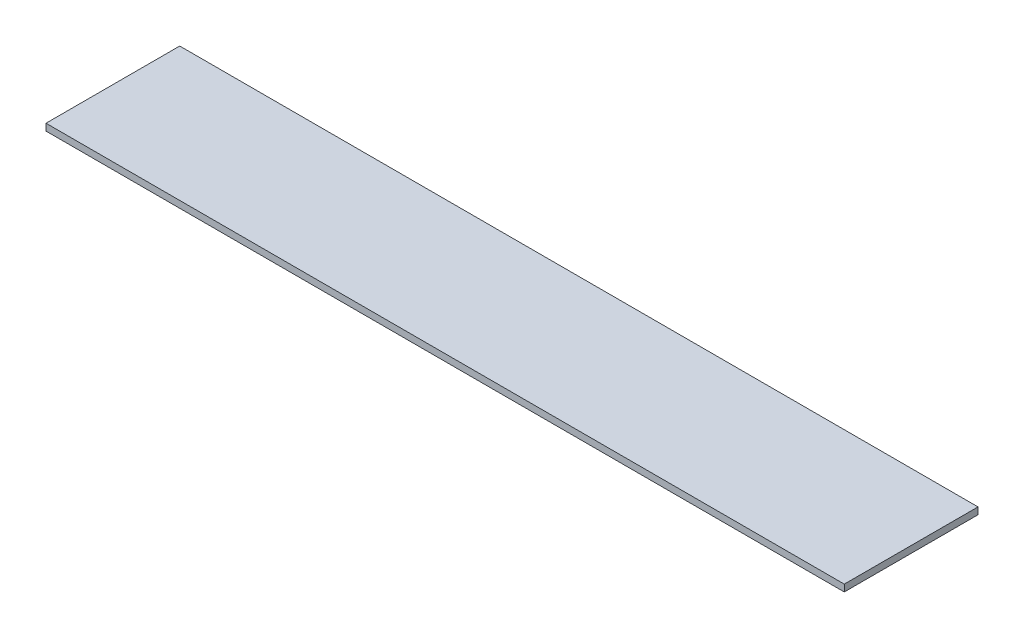
ISO-10303-21;
HEADER;
FILE_DESCRIPTION(('STEP AP214'),'2;1');
FILE_NAME('part.step','',(''),(''),'','','');
FILE_SCHEMA(('AUTOMOTIVE_DESIGN { 1 0 10303 214 1 1 1 1 }'));
ENDSEC;
DATA;
#1=APPLICATION_CONTEXT('core data for automotive mechanical design processes');
#2=APPLICATION_PROTOCOL_DEFINITION('international standard','automotive_design',2000,#1);
#3=PRODUCT_CONTEXT('',#1,'mechanical');
#4=PRODUCT('Part','Part','',(#3));
#5=PRODUCT_RELATED_PRODUCT_CATEGORY('part','',(#4));
#6=PRODUCT_DEFINITION_FORMATION('','',#4);
#7=PRODUCT_DEFINITION_CONTEXT('part definition',#1,'design');
#8=PRODUCT_DEFINITION('design','',#6,#7);
#9=PRODUCT_DEFINITION_SHAPE('','',#8);
#10=(LENGTH_UNIT() NAMED_UNIT(*) SI_UNIT(.MILLI.,.METRE.));
#11=(NAMED_UNIT(*) PLANE_ANGLE_UNIT() SI_UNIT($,.RADIAN.));
#12=(NAMED_UNIT(*) SI_UNIT($,.STERADIAN.) SOLID_ANGLE_UNIT());
#13=UNCERTAINTY_MEASURE_WITH_UNIT(LENGTH_MEASURE(1.E-05),#10,'distance_accuracy_value','');
#14=(GEOMETRIC_REPRESENTATION_CONTEXT(3) GLOBAL_UNCERTAINTY_ASSIGNED_CONTEXT((#13)) GLOBAL_UNIT_ASSIGNED_CONTEXT((#10,
#11,#12)) REPRESENTATION_CONTEXT('',''));
#15=CARTESIAN_POINT('',(0.,0.,0.));
#16=DIRECTION('',(0.,0.,1.));
#17=DIRECTION('',(1.,0.,0.));
#18=AXIS2_PLACEMENT_3D('',#15,#16,#17);
#19=CARTESIAN_POINT('',(-895.71735299863,14.2875,-410.353270092968));
#20=DIRECTION('',(1.,0.,0.));
#21=DIRECTION('',(0.,0.,-1.));
#22=AXIS2_PLACEMENT_3D('',#19,#20,#21);
#23=PLANE('',#22);
#24=DIRECTION('',(0.,0.,1.));
#25=VECTOR('',#24,1.);
#26=CARTESIAN_POINT('',(-895.71735299863,0.,-410.353270092968));
#27=LINE('',#26,#25);
#28=CARTESIAN_POINT('',(-895.71735299863,0.,-410.353270092968));
#29=VERTEX_POINT('',#28);
#30=CARTESIAN_POINT('',(-895.717352998629,0.,-130.953270092968));
#31=VERTEX_POINT('',#30);
#32=EDGE_CURVE('E98',#29,#31,#27,.T.);
#33=ORIENTED_EDGE('',*,*,#32,.T.);
#34=DIRECTION('',(0.,-1.,0.));
#35=VECTOR('',#34,1.);
#36=CARTESIAN_POINT('',(-895.717352998629,14.2875,-130.953270092968));
#37=LINE('',#36,#35);
#38=CARTESIAN_POINT('',(-895.717352998629,14.2875,-130.953270092968));
#39=VERTEX_POINT('',#38);
#40=EDGE_CURVE('E11',#39,#31,#37,.T.);
#41=ORIENTED_EDGE('',*,*,#40,.F.);
#42=DIRECTION('',(0.,0.,1.));
#43=VECTOR('',#42,1.);
#44=CARTESIAN_POINT('',(-895.71735299863,14.2875,-410.353270092968));
#45=LINE('',#44,#43);
#46=CARTESIAN_POINT('',(-895.71735299863,14.2875,-410.353270092968));
#47=VERTEX_POINT('',#46);
#48=EDGE_CURVE('E86',#47,#39,#45,.T.);
#49=ORIENTED_EDGE('',*,*,#48,.F.);
#50=DIRECTION('',(0.,-1.,0.));
#51=VECTOR('',#50,1.);
#52=CARTESIAN_POINT('',(-895.71735299863,14.2875,-410.353270092968));
#53=LINE('',#52,#51);
#54=EDGE_CURVE('E94',#47,#29,#53,.T.);
#55=ORIENTED_EDGE('',*,*,#54,.T.);
#56=EDGE_LOOP('',(#33,#41,#49,#55));
#57=FACE_BOUND('',#56,.T.);
#58=ADVANCED_FACE('F35',(#57),#23,.F.);
#59=CARTESIAN_POINT('',(-895.717352998629,14.2875,-130.953270092968));
#60=DIRECTION('',(0.,0.,-1.));
#61=DIRECTION('',(-1.,0.,0.));
#62=AXIS2_PLACEMENT_3D('',#59,#60,#61);
#63=PLANE('',#62);
#64=DIRECTION('',(1.,0.,0.));
#65=VECTOR('',#64,1.);
#66=CARTESIAN_POINT('',(-895.717352998629,0.,-130.953270092968));
#67=LINE('',#66,#65);
#68=CARTESIAN_POINT('',(772.17013189537,0.,-130.953270092968));
#69=VERTEX_POINT('',#68);
#70=EDGE_CURVE('E90',#31,#69,#67,.T.);
#71=ORIENTED_EDGE('',*,*,#70,.T.);
#72=DIRECTION('',(0.,-1.,0.));
#73=VECTOR('',#72,1.);
#74=CARTESIAN_POINT('',(772.17013189537,14.2875,-130.953270092968));
#75=LINE('',#74,#73);
#76=CARTESIAN_POINT('',(772.17013189537,14.2875,-130.953270092968));
#77=VERTEX_POINT('',#76);
#78=EDGE_CURVE('E43',#77,#69,#75,.T.);
#79=ORIENTED_EDGE('',*,*,#78,.F.);
#80=DIRECTION('',(1.,0.,0.));
#81=VECTOR('',#80,1.);
#82=CARTESIAN_POINT('',(-895.717352998629,14.2875,-130.953270092968));
#83=LINE('',#82,#81);
#84=EDGE_CURVE('E81',#39,#77,#83,.T.);
#85=ORIENTED_EDGE('',*,*,#84,.F.);
#86=ORIENTED_EDGE('',*,*,#40,.T.);
#87=EDGE_LOOP('',(#71,#79,#85,#86));
#88=FACE_BOUND('',#87,.T.);
#89=ADVANCED_FACE('F89',(#88),#63,.F.);
#90=CARTESIAN_POINT('',(772.170131895371,14.2875,-410.353270092968));
#91=DIRECTION('',(-1.,0.,0.));
#92=DIRECTION('',(0.,0.,1.));
#93=AXIS2_PLACEMENT_3D('',#90,#91,#92);
#94=PLANE('',#93);
#95=DIRECTION('',(0.,0.,-1.));
#96=VECTOR('',#95,1.);
#97=CARTESIAN_POINT('',(772.170131895371,0.,-410.353270092968));
#98=LINE('',#97,#96);
#99=CARTESIAN_POINT('',(772.170131895371,0.,-410.353270092968));
#100=VERTEX_POINT('',#99);
#101=EDGE_CURVE('E68',#69,#100,#98,.T.);
#102=ORIENTED_EDGE('',*,*,#101,.T.);
#103=DIRECTION('',(0.,-1.,0.));
#104=VECTOR('',#103,1.);
#105=CARTESIAN_POINT('',(772.170131895371,14.2875,-410.353270092968));
#106=LINE('',#105,#104);
#107=CARTESIAN_POINT('',(772.170131895371,14.2875,-410.353270092968));
#108=VERTEX_POINT('',#107);
#109=EDGE_CURVE('E91',#108,#100,#106,.T.);
#110=ORIENTED_EDGE('',*,*,#109,.F.);
#111=DIRECTION('',(0.,0.,-1.));
#112=VECTOR('',#111,1.);
#113=CARTESIAN_POINT('',(772.170131895371,14.2875,-410.353270092968));
#114=LINE('',#113,#112);
#115=EDGE_CURVE('E84',#77,#108,#114,.T.);
#116=ORIENTED_EDGE('',*,*,#115,.F.);
#117=ORIENTED_EDGE('',*,*,#78,.T.);
#118=EDGE_LOOP('',(#102,#110,#116,#117));
#119=FACE_BOUND('',#118,.T.);
#120=ADVANCED_FACE('F92',(#119),#94,.F.);
#121=CARTESIAN_POINT('',(-895.71735299863,14.2875,-410.353270092968));
#122=DIRECTION('',(0.,0.,1.));
#123=DIRECTION('',(1.,0.,0.));
#124=AXIS2_PLACEMENT_3D('',#121,#122,#123);
#125=PLANE('',#124);
#126=DIRECTION('',(-1.,0.,0.));
#127=VECTOR('',#126,1.);
#128=CARTESIAN_POINT('',(-895.71735299863,0.,-410.353270092968));
#129=LINE('',#128,#127);
#130=EDGE_CURVE('E74',#100,#29,#129,.T.);
#131=ORIENTED_EDGE('',*,*,#130,.T.);
#132=ORIENTED_EDGE('',*,*,#54,.F.);
#133=DIRECTION('',(-1.,0.,0.));
#134=VECTOR('',#133,1.);
#135=CARTESIAN_POINT('',(-895.71735299863,14.2875,-410.353270092968));
#136=LINE('',#135,#134);
#137=EDGE_CURVE('E51',#108,#47,#136,.T.);
#138=ORIENTED_EDGE('',*,*,#137,.F.);
#139=ORIENTED_EDGE('',*,*,#109,.T.);
#140=EDGE_LOOP('',(#131,#132,#138,#139));
#141=FACE_BOUND('',#140,.T.);
#142=ADVANCED_FACE('F105',(#141),#125,.F.);
#143=CARTESIAN_POINT('',(0.,14.2875,0.));
#144=DIRECTION('',(0.,1.,0.));
#145=DIRECTION('',(0.,0.,1.));
#146=AXIS2_PLACEMENT_3D('',#143,#144,#145);
#147=PLANE('',#146);
#148=ORIENTED_EDGE('',*,*,#48,.T.);
#149=ORIENTED_EDGE('',*,*,#84,.T.);
#150=ORIENTED_EDGE('',*,*,#115,.T.);
#151=ORIENTED_EDGE('',*,*,#137,.T.);
#152=EDGE_LOOP('',(#148,#149,#150,#151));
#153=FACE_BOUND('',#152,.T.);
#154=ADVANCED_FACE('F82',(#153),#147,.T.);
#155=CARTESIAN_POINT('',(0.,0.,0.));
#156=DIRECTION('',(0.,1.,0.));
#157=DIRECTION('',(0.,0.,1.));
#158=AXIS2_PLACEMENT_3D('',#155,#156,#157);
#159=PLANE('',#158);
#160=ORIENTED_EDGE('',*,*,#32,.F.);
#161=ORIENTED_EDGE('',*,*,#130,.F.);
#162=ORIENTED_EDGE('',*,*,#101,.F.);
#163=ORIENTED_EDGE('',*,*,#70,.F.);
#164=EDGE_LOOP('',(#160,#161,#162,#163));
#165=FACE_BOUND('',#164,.T.);
#166=ADVANCED_FACE('F108',(#165),#159,.F.);
#167=CLOSED_SHELL('',(#58,#89,#120,#142,#154,#166));
#168=MANIFOLD_SOLID_BREP('B2',#167);
#169=ADVANCED_BREP_SHAPE_REPRESENTATION('',(#18,#168),#14);
#170=SHAPE_DEFINITION_REPRESENTATION(#9,#169);
ENDSEC;
END-ISO-10303-21;
